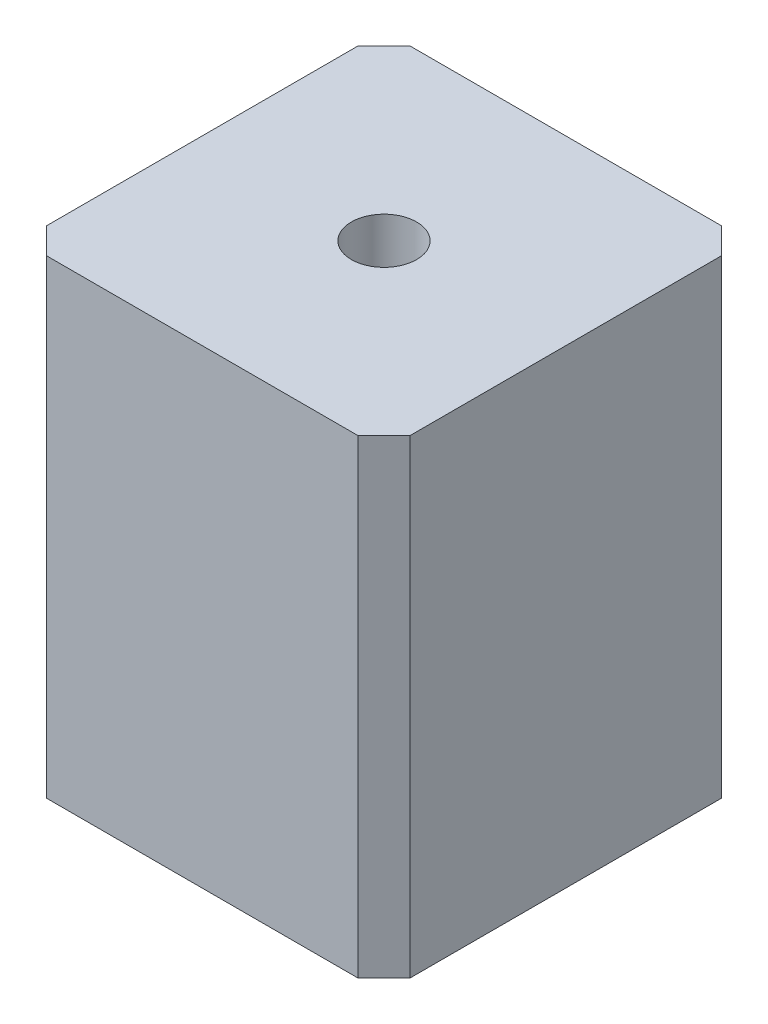
ISO-10303-21;
HEADER;
FILE_DESCRIPTION(('STEP AP214'),'2;1');
FILE_NAME('part.step','',(''),(''),'','','');
FILE_SCHEMA(('AUTOMOTIVE_DESIGN { 1 0 10303 214 1 1 1 1 }'));
ENDSEC;
DATA;
#1=APPLICATION_CONTEXT('core data for automotive mechanical design processes');
#2=APPLICATION_PROTOCOL_DEFINITION('international standard','automotive_design',2000,#1);
#3=PRODUCT_CONTEXT('',#1,'mechanical');
#4=PRODUCT('Part','Part','',(#3));
#5=PRODUCT_RELATED_PRODUCT_CATEGORY('part','',(#4));
#6=PRODUCT_DEFINITION_FORMATION('','',#4);
#7=PRODUCT_DEFINITION_CONTEXT('part definition',#1,'design');
#8=PRODUCT_DEFINITION('design','',#6,#7);
#9=PRODUCT_DEFINITION_SHAPE('','',#8);
#10=(LENGTH_UNIT() NAMED_UNIT(*) SI_UNIT(.MILLI.,.METRE.));
#11=(NAMED_UNIT(*) PLANE_ANGLE_UNIT() SI_UNIT($,.RADIAN.));
#12=(NAMED_UNIT(*) SI_UNIT($,.STERADIAN.) SOLID_ANGLE_UNIT());
#13=UNCERTAINTY_MEASURE_WITH_UNIT(LENGTH_MEASURE(1.E-05),#10,'distance_accuracy_value','');
#14=(GEOMETRIC_REPRESENTATION_CONTEXT(3) GLOBAL_UNCERTAINTY_ASSIGNED_CONTEXT((#13)) GLOBAL_UNIT_ASSIGNED_CONTEXT((#10,
#11,#12)) REPRESENTATION_CONTEXT('',''));
#15=CARTESIAN_POINT('',(0.,0.,0.));
#16=DIRECTION('',(0.,0.,1.));
#17=DIRECTION('',(1.,0.,0.));
#18=AXIS2_PLACEMENT_3D('',#15,#16,#17);
#19=CARTESIAN_POINT('',(0.,36.,0.));
#20=DIRECTION('',(0.,1.,0.));
#21=DIRECTION('',(0.,0.,1.));
#22=AXIS2_PLACEMENT_3D('',#19,#20,#21);
#23=PLANE('',#22);
#24=DIRECTION('',(1.,0.,0.));
#25=VECTOR('',#24,1.);
#26=CARTESIAN_POINT('',(-13.925,36.,13.925));
#27=LINE('',#26,#25);
#28=CARTESIAN_POINT('',(-11.925,36.,13.925));
#29=VERTEX_POINT('',#28);
#30=CARTESIAN_POINT('',(11.925,36.,13.925));
#31=VERTEX_POINT('',#30);
#32=EDGE_CURVE('E172',#29,#31,#27,.T.);
#33=ORIENTED_EDGE('',*,*,#32,.T.);
#34=DIRECTION('',(-0.707106781186549,0.,0.707106781186546));
#35=VECTOR('',#34,1.);
#36=CARTESIAN_POINT('',(12.925,36.,12.925));
#37=LINE('',#36,#35);
#38=CARTESIAN_POINT('',(13.925,36.,11.925));
#39=VERTEX_POINT('',#38);
#40=EDGE_CURVE('E149',#31,#39,#37,.F.);
#41=ORIENTED_EDGE('',*,*,#40,.T.);
#42=DIRECTION('',(0.,0.,-1.));
#43=VECTOR('',#42,1.);
#44=CARTESIAN_POINT('',(13.925,36.,13.925));
#45=LINE('',#44,#43);
#46=CARTESIAN_POINT('',(13.925,36.,-11.925));
#47=VERTEX_POINT('',#46);
#48=EDGE_CURVE('E120',#39,#47,#45,.T.);
#49=ORIENTED_EDGE('',*,*,#48,.T.);
#50=DIRECTION('',(0.707106781186546,0.,0.707106781186549));
#51=VECTOR('',#50,1.);
#52=CARTESIAN_POINT('',(12.925,36.,-12.925));
#53=LINE('',#52,#51);
#54=CARTESIAN_POINT('',(11.925,36.,-13.925));
#55=VERTEX_POINT('',#54);
#56=EDGE_CURVE('E144',#47,#55,#53,.F.);
#57=ORIENTED_EDGE('',*,*,#56,.T.);
#58=DIRECTION('',(-1.,0.,0.));
#59=VECTOR('',#58,1.);
#60=CARTESIAN_POINT('',(-13.925,36.,-13.925));
#61=LINE('',#60,#59);
#62=CARTESIAN_POINT('',(-11.925,36.,-13.925));
#63=VERTEX_POINT('',#62);
#64=EDGE_CURVE('E127',#55,#63,#61,.T.);
#65=ORIENTED_EDGE('',*,*,#64,.T.);
#66=DIRECTION('',(0.707106781186549,0.,-0.707106781186546));
#67=VECTOR('',#66,1.);
#68=CARTESIAN_POINT('',(-12.925,36.,-12.925));
#69=LINE('',#68,#67);
#70=CARTESIAN_POINT('',(-13.925,36.,-11.925));
#71=VERTEX_POINT('',#70);
#72=EDGE_CURVE('E56',#63,#71,#69,.F.);
#73=ORIENTED_EDGE('',*,*,#72,.T.);
#74=DIRECTION('',(0.,0.,1.));
#75=VECTOR('',#74,1.);
#76=CARTESIAN_POINT('',(-13.925,36.,13.925));
#77=LINE('',#76,#75);
#78=CARTESIAN_POINT('',(-13.925,36.,11.925));
#79=VERTEX_POINT('',#78);
#80=EDGE_CURVE('E130',#71,#79,#77,.T.);
#81=ORIENTED_EDGE('',*,*,#80,.T.);
#82=DIRECTION('',(-0.707106781186546,0.,-0.707106781186549));
#83=VECTOR('',#82,1.);
#84=CARTESIAN_POINT('',(-12.925,36.,12.925));
#85=LINE('',#84,#83);
#86=EDGE_CURVE('E147',#79,#29,#85,.F.);
#87=ORIENTED_EDGE('',*,*,#86,.T.);
#88=EDGE_LOOP('',(#33,#41,#49,#57,#65,#73,#81,#87));
#89=FACE_BOUND('',#88,.T.);
#90=CARTESIAN_POINT('',(0.,36.,0.));
#91=DIRECTION('',(0.,1.,0.));
#92=DIRECTION('',(0.,0.,1.));
#93=AXIS2_PLACEMENT_3D('',#90,#91,#92);
#94=CIRCLE('',#93,2.5);
#95=CARTESIAN_POINT('',(0.,36.,2.5));
#96=VERTEX_POINT('',#95);
#97=EDGE_CURVE('E165',#96,#96,#94,.T.);
#98=ORIENTED_EDGE('',*,*,#97,.F.);
#99=EDGE_LOOP('',(#98));
#100=FACE_BOUND('',#99,.T.);
#101=ADVANCED_FACE('F34',(#89,#100),#23,.T.);
#102=CARTESIAN_POINT('',(0.,0.,0.));
#103=DIRECTION('',(0.,1.,0.));
#104=DIRECTION('',(0.,0.,1.));
#105=AXIS2_PLACEMENT_3D('',#102,#103,#104);
#106=PLANE('',#105);
#107=DIRECTION('',(0.,0.,-1.));
#108=VECTOR('',#107,1.);
#109=CARTESIAN_POINT('',(13.925,0.,13.925));
#110=LINE('',#109,#108);
#111=CARTESIAN_POINT('',(13.925,0.,11.925));
#112=VERTEX_POINT('',#111);
#113=CARTESIAN_POINT('',(13.925,0.,-11.925));
#114=VERTEX_POINT('',#113);
#115=EDGE_CURVE('E117',#112,#114,#110,.T.);
#116=ORIENTED_EDGE('',*,*,#115,.F.);
#117=DIRECTION('',(0.707106781186549,0.,-0.707106781186546));
#118=VECTOR('',#117,1.);
#119=CARTESIAN_POINT('',(13.925,0.,11.925));
#120=LINE('',#119,#118);
#121=CARTESIAN_POINT('',(11.925,0.,13.925));
#122=VERTEX_POINT('',#121);
#123=EDGE_CURVE('E100',#112,#122,#120,.F.);
#124=ORIENTED_EDGE('',*,*,#123,.T.);
#125=DIRECTION('',(1.,0.,0.));
#126=VECTOR('',#125,1.);
#127=CARTESIAN_POINT('',(-13.925,0.,13.925));
#128=LINE('',#127,#126);
#129=CARTESIAN_POINT('',(-11.925,0.,13.925));
#130=VERTEX_POINT('',#129);
#131=EDGE_CURVE('E128',#130,#122,#128,.T.);
#132=ORIENTED_EDGE('',*,*,#131,.F.);
#133=DIRECTION('',(0.707106781186546,0.,0.707106781186549));
#134=VECTOR('',#133,1.);
#135=CARTESIAN_POINT('',(-11.925,0.,13.925));
#136=LINE('',#135,#134);
#137=CARTESIAN_POINT('',(-13.925,0.,11.925));
#138=VERTEX_POINT('',#137);
#139=EDGE_CURVE('E111',#130,#138,#136,.F.);
#140=ORIENTED_EDGE('',*,*,#139,.T.);
#141=DIRECTION('',(0.,0.,1.));
#142=VECTOR('',#141,1.);
#143=CARTESIAN_POINT('',(-13.925,0.,13.925));
#144=LINE('',#143,#142);
#145=CARTESIAN_POINT('',(-13.925,0.,-11.925));
#146=VERTEX_POINT('',#145);
#147=EDGE_CURVE('E132',#146,#138,#144,.T.);
#148=ORIENTED_EDGE('',*,*,#147,.F.);
#149=DIRECTION('',(-0.707106781186549,0.,0.707106781186546));
#150=VECTOR('',#149,1.);
#151=CARTESIAN_POINT('',(-13.925,0.,-11.925));
#152=LINE('',#151,#150);
#153=CARTESIAN_POINT('',(-11.925,0.,-13.925));
#154=VERTEX_POINT('',#153);
#155=EDGE_CURVE('E138',#146,#154,#152,.F.);
#156=ORIENTED_EDGE('',*,*,#155,.T.);
#157=DIRECTION('',(-1.,0.,0.));
#158=VECTOR('',#157,1.);
#159=CARTESIAN_POINT('',(-13.925,0.,-13.925));
#160=LINE('',#159,#158);
#161=CARTESIAN_POINT('',(11.925,0.,-13.925));
#162=VERTEX_POINT('',#161);
#163=EDGE_CURVE('E160',#162,#154,#160,.T.);
#164=ORIENTED_EDGE('',*,*,#163,.F.);
#165=DIRECTION('',(-0.707106781186546,0.,-0.707106781186549));
#166=VECTOR('',#165,1.);
#167=CARTESIAN_POINT('',(11.925,0.,-13.925));
#168=LINE('',#167,#166);
#169=EDGE_CURVE('E121',#162,#114,#168,.F.);
#170=ORIENTED_EDGE('',*,*,#169,.T.);
#171=EDGE_LOOP('',(#116,#124,#132,#140,#148,#156,#164,#170));
#172=FACE_BOUND('',#171,.T.);
#173=CARTESIAN_POINT('',(0.,0.,0.));
#174=DIRECTION('',(0.,1.,0.));
#175=DIRECTION('',(0.,0.,1.));
#176=AXIS2_PLACEMENT_3D('',#173,#174,#175);
#177=CIRCLE('',#176,2.5);
#178=CARTESIAN_POINT('',(0.,0.,2.5));
#179=VERTEX_POINT('',#178);
#180=EDGE_CURVE('E168',#179,#179,#177,.T.);
#181=ORIENTED_EDGE('',*,*,#180,.T.);
#182=EDGE_LOOP('',(#181));
#183=FACE_BOUND('',#182,.T.);
#184=ADVANCED_FACE('F124',(#172,#183),#106,.F.);
#185=CARTESIAN_POINT('',(-13.925,36.,-13.925));
#186=DIRECTION('',(0.,0.,1.));
#187=DIRECTION('',(1.,0.,0.));
#188=AXIS2_PLACEMENT_3D('',#185,#186,#187);
#189=PLANE('',#188);
#190=ORIENTED_EDGE('',*,*,#163,.T.);
#191=DIRECTION('',(0.,1.,0.));
#192=VECTOR('',#191,1.);
#193=CARTESIAN_POINT('',(-11.925,36.,-13.925));
#194=LINE('',#193,#192);
#195=EDGE_CURVE('E11',#154,#63,#194,.T.);
#196=ORIENTED_EDGE('',*,*,#195,.T.);
#197=ORIENTED_EDGE('',*,*,#64,.F.);
#198=DIRECTION('',(0.,-1.,0.));
#199=VECTOR('',#198,1.);
#200=CARTESIAN_POINT('',(11.925,36.,-13.925));
#201=LINE('',#200,#199);
#202=EDGE_CURVE('E42',#55,#162,#201,.T.);
#203=ORIENTED_EDGE('',*,*,#202,.T.);
#204=EDGE_LOOP('',(#190,#196,#197,#203));
#205=FACE_BOUND('',#204,.T.);
#206=ADVANCED_FACE('F159',(#205),#189,.F.);
#207=CARTESIAN_POINT('',(-13.925,36.,13.925));
#208=DIRECTION('',(1.,0.,0.));
#209=DIRECTION('',(0.,0.,-1.));
#210=AXIS2_PLACEMENT_3D('',#207,#208,#209);
#211=PLANE('',#210);
#212=ORIENTED_EDGE('',*,*,#147,.T.);
#213=DIRECTION('',(0.,1.,0.));
#214=VECTOR('',#213,1.);
#215=CARTESIAN_POINT('',(-13.925,36.,11.925));
#216=LINE('',#215,#214);
#217=EDGE_CURVE('E49',#138,#79,#216,.T.);
#218=ORIENTED_EDGE('',*,*,#217,.T.);
#219=ORIENTED_EDGE('',*,*,#80,.F.);
#220=DIRECTION('',(0.,-1.,0.));
#221=VECTOR('',#220,1.);
#222=CARTESIAN_POINT('',(-13.925,36.,-11.925));
#223=LINE('',#222,#221);
#224=EDGE_CURVE('E151',#71,#146,#223,.T.);
#225=ORIENTED_EDGE('',*,*,#224,.T.);
#226=EDGE_LOOP('',(#212,#218,#219,#225));
#227=FACE_BOUND('',#226,.T.);
#228=ADVANCED_FACE('F201',(#227),#211,.F.);
#229=CARTESIAN_POINT('',(-13.925,36.,13.925));
#230=DIRECTION('',(0.,0.,-1.));
#231=DIRECTION('',(-1.,0.,0.));
#232=AXIS2_PLACEMENT_3D('',#229,#230,#231);
#233=PLANE('',#232);
#234=ORIENTED_EDGE('',*,*,#131,.T.);
#235=DIRECTION('',(0.,1.,0.));
#236=VECTOR('',#235,1.);
#237=CARTESIAN_POINT('',(11.925,36.,13.925));
#238=LINE('',#237,#236);
#239=EDGE_CURVE('E105',#122,#31,#238,.T.);
#240=ORIENTED_EDGE('',*,*,#239,.T.);
#241=ORIENTED_EDGE('',*,*,#32,.F.);
#242=DIRECTION('',(0.,-1.,0.));
#243=VECTOR('',#242,1.);
#244=CARTESIAN_POINT('',(-11.925,36.,13.925));
#245=LINE('',#244,#243);
#246=EDGE_CURVE('E110',#29,#130,#245,.T.);
#247=ORIENTED_EDGE('',*,*,#246,.T.);
#248=EDGE_LOOP('',(#234,#240,#241,#247));
#249=FACE_BOUND('',#248,.T.);
#250=ADVANCED_FACE('F189',(#249),#233,.F.);
#251=CARTESIAN_POINT('',(13.925,36.,13.925));
#252=DIRECTION('',(-1.,0.,0.));
#253=DIRECTION('',(0.,0.,1.));
#254=AXIS2_PLACEMENT_3D('',#251,#252,#253);
#255=PLANE('',#254);
#256=ORIENTED_EDGE('',*,*,#48,.F.);
#257=DIRECTION('',(0.,-1.,0.));
#258=VECTOR('',#257,1.);
#259=CARTESIAN_POINT('',(13.925,36.,11.925));
#260=LINE('',#259,#258);
#261=EDGE_CURVE('E104',#39,#112,#260,.T.);
#262=ORIENTED_EDGE('',*,*,#261,.T.);
#263=ORIENTED_EDGE('',*,*,#115,.T.);
#264=DIRECTION('',(0.,1.,0.));
#265=VECTOR('',#264,1.);
#266=CARTESIAN_POINT('',(13.925,36.,-11.925));
#267=LINE('',#266,#265);
#268=EDGE_CURVE('E122',#114,#47,#267,.T.);
#269=ORIENTED_EDGE('',*,*,#268,.T.);
#270=EDGE_LOOP('',(#256,#262,#263,#269));
#271=FACE_BOUND('',#270,.T.);
#272=ADVANCED_FACE('F116',(#271),#255,.F.);
#273=CARTESIAN_POINT('',(0.,36.,0.));
#274=DIRECTION('',(0.,-1.,0.));
#275=DIRECTION('',(0.,0.,-1.));
#276=AXIS2_PLACEMENT_3D('',#273,#274,#275);
#277=CYLINDRICAL_SURFACE('',#276,2.5);
#278=ORIENTED_EDGE('',*,*,#97,.T.);
#279=EDGE_LOOP('',(#278));
#280=FACE_BOUND('',#279,.T.);
#281=ORIENTED_EDGE('',*,*,#180,.F.);
#282=EDGE_LOOP('',(#281));
#283=FACE_BOUND('',#282,.T.);
#284=ADVANCED_FACE('F179',(#280,#283),#277,.F.);
#285=CARTESIAN_POINT('',(13.925,36.,11.925));
#286=DIRECTION('',(-0.707106781186546,0.,-0.707106781186549));
#287=DIRECTION('',(0.,-1.,0.));
#288=AXIS2_PLACEMENT_3D('',#285,#286,#287);
#289=PLANE('',#288);
#290=ORIENTED_EDGE('',*,*,#40,.F.);
#291=ORIENTED_EDGE('',*,*,#239,.F.);
#292=ORIENTED_EDGE('',*,*,#123,.F.);
#293=ORIENTED_EDGE('',*,*,#261,.F.);
#294=EDGE_LOOP('',(#290,#291,#292,#293));
#295=FACE_BOUND('',#294,.T.);
#296=ADVANCED_FACE('F103',(#295),#289,.F.);
#297=CARTESIAN_POINT('',(-11.925,36.,13.925));
#298=DIRECTION('',(0.707106781186549,0.,-0.707106781186546));
#299=DIRECTION('',(0.,-1.,0.));
#300=AXIS2_PLACEMENT_3D('',#297,#298,#299);
#301=PLANE('',#300);
#302=ORIENTED_EDGE('',*,*,#86,.F.);
#303=ORIENTED_EDGE('',*,*,#217,.F.);
#304=ORIENTED_EDGE('',*,*,#139,.F.);
#305=ORIENTED_EDGE('',*,*,#246,.F.);
#306=EDGE_LOOP('',(#302,#303,#304,#305));
#307=FACE_BOUND('',#306,.T.);
#308=ADVANCED_FACE('F187',(#307),#301,.F.);
#309=CARTESIAN_POINT('',(-13.925,36.,-11.925));
#310=DIRECTION('',(0.707106781186546,0.,0.707106781186549));
#311=DIRECTION('',(0.,-1.,0.));
#312=AXIS2_PLACEMENT_3D('',#309,#310,#311);
#313=PLANE('',#312);
#314=ORIENTED_EDGE('',*,*,#72,.F.);
#315=ORIENTED_EDGE('',*,*,#195,.F.);
#316=ORIENTED_EDGE('',*,*,#155,.F.);
#317=ORIENTED_EDGE('',*,*,#224,.F.);
#318=EDGE_LOOP('',(#314,#315,#316,#317));
#319=FACE_BOUND('',#318,.T.);
#320=ADVANCED_FACE('F208',(#319),#313,.F.);
#321=CARTESIAN_POINT('',(11.925,36.,-13.925));
#322=DIRECTION('',(-0.707106781186549,0.,0.707106781186546));
#323=DIRECTION('',(0.,-1.,0.));
#324=AXIS2_PLACEMENT_3D('',#321,#322,#323);
#325=PLANE('',#324);
#326=ORIENTED_EDGE('',*,*,#56,.F.);
#327=ORIENTED_EDGE('',*,*,#268,.F.);
#328=ORIENTED_EDGE('',*,*,#169,.F.);
#329=ORIENTED_EDGE('',*,*,#202,.F.);
#330=EDGE_LOOP('',(#326,#327,#328,#329));
#331=FACE_BOUND('',#330,.T.);
#332=ADVANCED_FACE('F36',(#331),#325,.F.);
#333=CLOSED_SHELL('',(#101,#184,#206,#228,#250,#272,#284,#296,#308,#320,#332));
#334=MANIFOLD_SOLID_BREP('B2',#333);
#335=ADVANCED_BREP_SHAPE_REPRESENTATION('',(#18,#334),#14);
#336=SHAPE_DEFINITION_REPRESENTATION(#9,#335);
ENDSEC;
END-ISO-10303-21;
